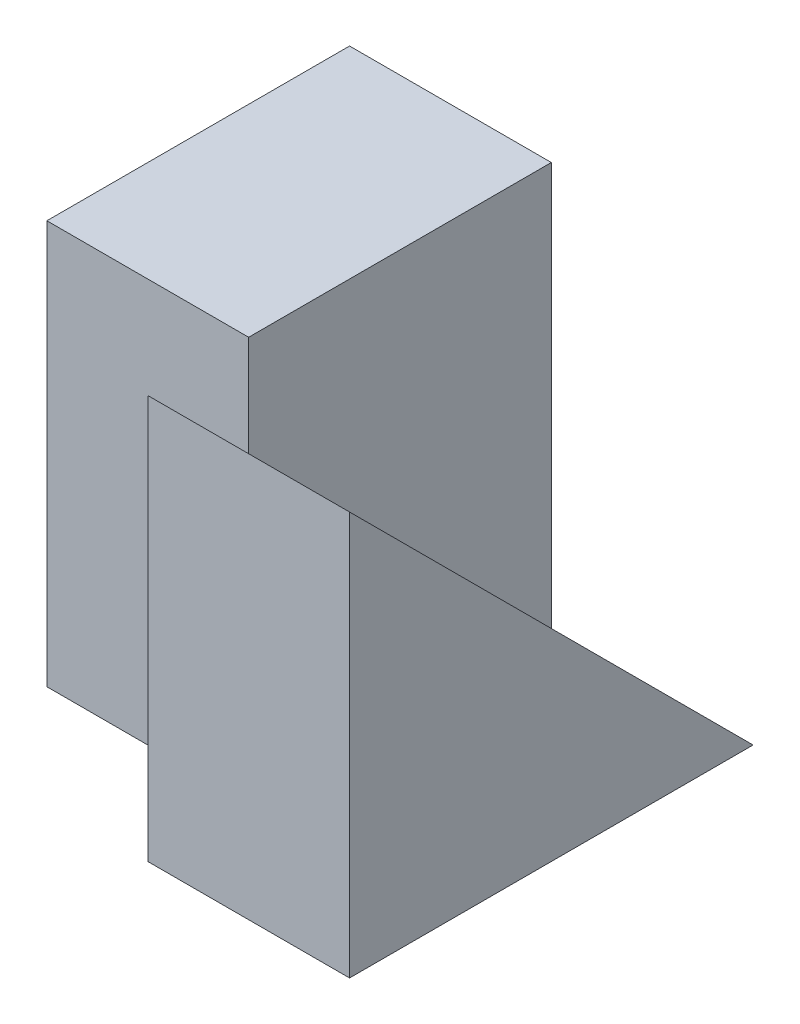
ISO-10303-21;
HEADER;
FILE_DESCRIPTION(('STEP AP214'),'2;1');
FILE_NAME('part.step','',(''),(''),'','','');
FILE_SCHEMA(('AUTOMOTIVE_DESIGN { 1 0 10303 214 1 1 1 1 }'));
ENDSEC;
DATA;
#1=APPLICATION_CONTEXT('core data for automotive mechanical design processes');
#2=APPLICATION_PROTOCOL_DEFINITION('international standard','automotive_design',2000,#1);
#3=PRODUCT_CONTEXT('',#1,'mechanical');
#4=PRODUCT('Part','Part','',(#3));
#5=PRODUCT_RELATED_PRODUCT_CATEGORY('part','',(#4));
#6=PRODUCT_DEFINITION_FORMATION('','',#4);
#7=PRODUCT_DEFINITION_CONTEXT('part definition',#1,'design');
#8=PRODUCT_DEFINITION('design','',#6,#7);
#9=PRODUCT_DEFINITION_SHAPE('','',#8);
#10=(LENGTH_UNIT() NAMED_UNIT(*) SI_UNIT(.MILLI.,.METRE.));
#11=(NAMED_UNIT(*) PLANE_ANGLE_UNIT() SI_UNIT($,.RADIAN.));
#12=(NAMED_UNIT(*) SI_UNIT($,.STERADIAN.) SOLID_ANGLE_UNIT());
#13=UNCERTAINTY_MEASURE_WITH_UNIT(LENGTH_MEASURE(1.E-05),#10,'distance_accuracy_value','');
#14=(GEOMETRIC_REPRESENTATION_CONTEXT(3) GLOBAL_UNCERTAINTY_ASSIGNED_CONTEXT((#13)) GLOBAL_UNIT_ASSIGNED_CONTEXT((#10,
#11,#12)) REPRESENTATION_CONTEXT('',''));
#15=CARTESIAN_POINT('',(0.,0.,0.));
#16=DIRECTION('',(0.,0.,1.));
#17=DIRECTION('',(1.,0.,0.));
#18=AXIS2_PLACEMENT_3D('',#15,#16,#17);
#19=CARTESIAN_POINT('',(2.,0.,-4.));
#20=DIRECTION('',(0.,0.,1.));
#21=DIRECTION('',(1.,0.,0.));
#22=AXIS2_PLACEMENT_3D('',#19,#20,#21);
#23=PLANE('',#22);
#24=DIRECTION('',(0.,1.,0.));
#25=VECTOR('',#24,1.);
#26=CARTESIAN_POINT('',(0.,4.,-4.));
#27=LINE('',#26,#25);
#28=CARTESIAN_POINT('',(0.,0.,-4.));
#29=VERTEX_POINT('',#28);
#30=CARTESIAN_POINT('',(0.,4.,-4.));
#31=VERTEX_POINT('',#30);
#32=EDGE_CURVE('E96',#29,#31,#27,.T.);
#33=ORIENTED_EDGE('',*,*,#32,.F.);
#34=DIRECTION('',(-1.,0.,0.));
#35=VECTOR('',#34,1.);
#36=CARTESIAN_POINT('',(2.,0.,-4.));
#37=LINE('',#36,#35);
#38=CARTESIAN_POINT('',(-2.,0.,-4.));
#39=VERTEX_POINT('',#38);
#40=EDGE_CURVE('E121',#29,#39,#37,.T.);
#41=ORIENTED_EDGE('',*,*,#40,.T.);
#42=DIRECTION('',(0.,-1.,0.));
#43=VECTOR('',#42,1.);
#44=CARTESIAN_POINT('',(-2.,4.,-4.));
#45=LINE('',#44,#43);
#46=CARTESIAN_POINT('',(-2.,4.,-4.));
#47=VERTEX_POINT('',#46);
#48=EDGE_CURVE('E120',#47,#39,#45,.T.);
#49=ORIENTED_EDGE('',*,*,#48,.F.);
#50=DIRECTION('',(-1.,0.,0.));
#51=VECTOR('',#50,1.);
#52=CARTESIAN_POINT('',(2.,4.,-4.));
#53=LINE('',#52,#51);
#54=EDGE_CURVE('E113',#31,#47,#53,.T.);
#55=ORIENTED_EDGE('',*,*,#54,.F.);
#56=EDGE_LOOP('',(#33,#41,#49,#55));
#57=FACE_BOUND('',#56,.T.);
#58=ADVANCED_FACE('F33',(#57),#23,.F.);
#59=CARTESIAN_POINT('',(2.,4.,0.));
#60=DIRECTION('',(0.,-1.,0.));
#61=DIRECTION('',(0.,0.,-1.));
#62=AXIS2_PLACEMENT_3D('',#59,#60,#61);
#63=PLANE('',#62);
#64=DIRECTION('',(0.,0.,1.));
#65=VECTOR('',#64,1.);
#66=CARTESIAN_POINT('',(0.,3.99999999999996,0.));
#67=LINE('',#66,#65);
#68=CARTESIAN_POINT('',(0.,4.,-1.));
#69=VERTEX_POINT('',#68);
#70=EDGE_CURVE('E99',#31,#69,#67,.T.);
#71=ORIENTED_EDGE('',*,*,#70,.F.);
#72=ORIENTED_EDGE('',*,*,#54,.T.);
#73=DIRECTION('',(0.,0.,-1.));
#74=VECTOR('',#73,1.);
#75=CARTESIAN_POINT('',(-2.,4.,-1.));
#76=LINE('',#75,#74);
#77=CARTESIAN_POINT('',(-2.,4.,-1.));
#78=VERTEX_POINT('',#77);
#79=EDGE_CURVE('E144',#78,#47,#76,.T.);
#80=ORIENTED_EDGE('',*,*,#79,.F.);
#81=DIRECTION('',(1.,0.,0.));
#82=VECTOR('',#81,1.);
#83=CARTESIAN_POINT('',(-2.,4.,-1.));
#84=LINE('',#83,#82);
#85=EDGE_CURVE('E116',#78,#69,#84,.T.);
#86=ORIENTED_EDGE('',*,*,#85,.T.);
#87=EDGE_LOOP('',(#71,#72,#80,#86));
#88=FACE_BOUND('',#87,.T.);
#89=ADVANCED_FACE('F111',(#88),#63,.F.);
#90=CARTESIAN_POINT('',(2.,0.,0.));
#91=DIRECTION('',(0.,0.,-1.));
#92=DIRECTION('',(-1.,0.,0.));
#93=AXIS2_PLACEMENT_3D('',#90,#91,#92);
#94=PLANE('',#93);
#95=DIRECTION('',(0.,-1.,0.));
#96=VECTOR('',#95,1.);
#97=CARTESIAN_POINT('',(0.,0.,0.));
#98=LINE('',#97,#96);
#99=CARTESIAN_POINT('',(0.,3.99999999999996,0.));
#100=VERTEX_POINT('',#99);
#101=CARTESIAN_POINT('',(0.,0.,0.));
#102=VERTEX_POINT('',#101);
#103=EDGE_CURVE('E132',#100,#102,#98,.T.);
#104=ORIENTED_EDGE('',*,*,#103,.T.);
#105=DIRECTION('',(-1.,0.,0.));
#106=VECTOR('',#105,1.);
#107=CARTESIAN_POINT('',(2.,0.,0.));
#108=LINE('',#107,#106);
#109=CARTESIAN_POINT('',(2.,0.,0.));
#110=VERTEX_POINT('',#109);
#111=EDGE_CURVE('E11',#110,#102,#108,.T.);
#112=ORIENTED_EDGE('',*,*,#111,.F.);
#113=DIRECTION('',(0.,-1.,0.));
#114=VECTOR('',#113,1.);
#115=CARTESIAN_POINT('',(2.,0.,0.));
#116=LINE('',#115,#114);
#117=CARTESIAN_POINT('',(2.,3.99999999999996,0.));
#118=VERTEX_POINT('',#117);
#119=EDGE_CURVE('E131',#118,#110,#116,.T.);
#120=ORIENTED_EDGE('',*,*,#119,.F.);
#121=DIRECTION('',(-1.,0.,0.));
#122=VECTOR('',#121,1.);
#123=CARTESIAN_POINT('',(2.,4.,0.));
#124=LINE('',#123,#122);
#125=EDGE_CURVE('E122',#118,#100,#124,.T.);
#126=ORIENTED_EDGE('',*,*,#125,.T.);
#127=EDGE_LOOP('',(#104,#112,#120,#126));
#128=FACE_BOUND('',#127,.T.);
#129=ADVANCED_FACE('F35',(#128),#94,.F.);
#130=CARTESIAN_POINT('',(2.,0.,0.));
#131=DIRECTION('',(0.,1.,0.));
#132=DIRECTION('',(0.,0.,1.));
#133=AXIS2_PLACEMENT_3D('',#130,#131,#132);
#134=PLANE('',#133);
#135=DIRECTION('',(0.,0.,-1.));
#136=VECTOR('',#135,1.);
#137=CARTESIAN_POINT('',(0.,0.,0.));
#138=LINE('',#137,#136);
#139=CARTESIAN_POINT('',(0.,0.,-1.));
#140=VERTEX_POINT('',#139);
#141=EDGE_CURVE('E129',#102,#140,#138,.T.);
#142=ORIENTED_EDGE('',*,*,#141,.T.);
#143=DIRECTION('',(1.,0.,0.));
#144=VECTOR('',#143,1.);
#145=CARTESIAN_POINT('',(-2.,0.,-1.));
#146=LINE('',#145,#144);
#147=CARTESIAN_POINT('',(-2.,0.,-1.));
#148=VERTEX_POINT('',#147);
#149=EDGE_CURVE('E138',#148,#140,#146,.T.);
#150=ORIENTED_EDGE('',*,*,#149,.F.);
#151=DIRECTION('',(0.,0.,1.));
#152=VECTOR('',#151,1.);
#153=CARTESIAN_POINT('',(-2.,0.,-4.));
#154=LINE('',#153,#152);
#155=EDGE_CURVE('E148',#39,#148,#154,.T.);
#156=ORIENTED_EDGE('',*,*,#155,.F.);
#157=ORIENTED_EDGE('',*,*,#40,.F.);
#158=CARTESIAN_POINT('',(2.,0.,-4.));
#159=VERTEX_POINT('',#158);
#160=EDGE_CURVE('E43',#159,#29,#37,.T.);
#161=ORIENTED_EDGE('',*,*,#160,.F.);
#162=DIRECTION('',(0.,0.,-1.));
#163=VECTOR('',#162,1.);
#164=CARTESIAN_POINT('',(2.,0.,0.));
#165=LINE('',#164,#163);
#166=EDGE_CURVE('E59',#110,#159,#165,.T.);
#167=ORIENTED_EDGE('',*,*,#166,.F.);
#168=ORIENTED_EDGE('',*,*,#111,.T.);
#169=EDGE_LOOP('',(#142,#150,#156,#157,#161,#167,#168));
#170=FACE_BOUND('',#169,.T.);
#171=ADVANCED_FACE('F165',(#170),#134,.F.);
#172=CARTESIAN_POINT('',(2.,0.,0.));
#173=DIRECTION('',(-1.,0.,0.));
#174=DIRECTION('',(0.,0.,1.));
#175=AXIS2_PLACEMENT_3D('',#172,#173,#174);
#176=PLANE('',#175);
#177=ORIENTED_EDGE('',*,*,#166,.T.);
#178=DIRECTION('',(0.,-0.707106781186544,-0.707106781186551));
#179=VECTOR('',#178,1.);
#180=CARTESIAN_POINT('',(2.,0.,-4.));
#181=LINE('',#180,#179);
#182=EDGE_CURVE('E107',#118,#159,#181,.T.);
#183=ORIENTED_EDGE('',*,*,#182,.F.);
#184=ORIENTED_EDGE('',*,*,#119,.T.);
#185=EDGE_LOOP('',(#177,#183,#184));
#186=FACE_BOUND('',#185,.T.);
#187=ADVANCED_FACE('F174',(#186),#176,.F.);
#188=CARTESIAN_POINT('',(0.,0.,0.));
#189=DIRECTION('',(-1.,0.,0.));
#190=DIRECTION('',(0.,0.,1.));
#191=AXIS2_PLACEMENT_3D('',#188,#189,#190);
#192=PLANE('',#191);
#193=DIRECTION('',(0.,-0.707106781186544,-0.707106781186551));
#194=VECTOR('',#193,1.);
#195=CARTESIAN_POINT('',(0.,0.,-4.));
#196=LINE('',#195,#194);
#197=CARTESIAN_POINT('',(0.,2.99999999999997,-1.));
#198=VERTEX_POINT('',#197);
#199=EDGE_CURVE('E154',#100,#198,#196,.T.);
#200=ORIENTED_EDGE('',*,*,#199,.T.);
#201=DIRECTION('',(0.,1.,0.));
#202=VECTOR('',#201,1.);
#203=CARTESIAN_POINT('',(0.,0.,-1.));
#204=LINE('',#203,#202);
#205=EDGE_CURVE('E51',#140,#198,#204,.T.);
#206=ORIENTED_EDGE('',*,*,#205,.F.);
#207=ORIENTED_EDGE('',*,*,#141,.F.);
#208=ORIENTED_EDGE('',*,*,#103,.F.);
#209=EDGE_LOOP('',(#200,#206,#207,#208));
#210=FACE_BOUND('',#209,.T.);
#211=ADVANCED_FACE('F167',(#210),#192,.T.);
#212=CARTESIAN_POINT('',(-2.,0.,-1.));
#213=DIRECTION('',(0.,0.,-1.));
#214=DIRECTION('',(-1.,0.,0.));
#215=AXIS2_PLACEMENT_3D('',#212,#213,#214);
#216=PLANE('',#215);
#217=ORIENTED_EDGE('',*,*,#205,.T.);
#218=EDGE_CURVE('E37',#198,#69,#204,.T.);
#219=ORIENTED_EDGE('',*,*,#218,.T.);
#220=ORIENTED_EDGE('',*,*,#85,.F.);
#221=DIRECTION('',(0.,1.,0.));
#222=VECTOR('',#221,1.);
#223=CARTESIAN_POINT('',(-2.,0.,-1.));
#224=LINE('',#223,#222);
#225=EDGE_CURVE('E146',#148,#78,#224,.T.);
#226=ORIENTED_EDGE('',*,*,#225,.F.);
#227=ORIENTED_EDGE('',*,*,#149,.T.);
#228=EDGE_LOOP('',(#217,#219,#220,#226,#227));
#229=FACE_BOUND('',#228,.T.);
#230=ADVANCED_FACE('F158',(#229),#216,.F.);
#231=CARTESIAN_POINT('',(-2.,0.,0.));
#232=DIRECTION('',(-1.,0.,0.));
#233=DIRECTION('',(0.,0.,1.));
#234=AXIS2_PLACEMENT_3D('',#231,#232,#233);
#235=PLANE('',#234);
#236=ORIENTED_EDGE('',*,*,#155,.T.);
#237=ORIENTED_EDGE('',*,*,#225,.T.);
#238=ORIENTED_EDGE('',*,*,#79,.T.);
#239=ORIENTED_EDGE('',*,*,#48,.T.);
#240=EDGE_LOOP('',(#236,#237,#238,#239));
#241=FACE_BOUND('',#240,.T.);
#242=ADVANCED_FACE('F176',(#241),#235,.T.);
#243=CARTESIAN_POINT('',(0.,0.,0.));
#244=DIRECTION('',(1.,0.,0.));
#245=DIRECTION('',(0.,0.,-1.));
#246=AXIS2_PLACEMENT_3D('',#243,#244,#245);
#247=PLANE('',#246);
#248=ORIENTED_EDGE('',*,*,#218,.F.);
#249=EDGE_CURVE('E102',#198,#29,#196,.T.);
#250=ORIENTED_EDGE('',*,*,#249,.T.);
#251=ORIENTED_EDGE('',*,*,#32,.T.);
#252=ORIENTED_EDGE('',*,*,#70,.T.);
#253=EDGE_LOOP('',(#248,#250,#251,#252));
#254=FACE_BOUND('',#253,.T.);
#255=ADVANCED_FACE('F98',(#254),#247,.T.);
#256=CARTESIAN_POINT('',(0.,0.,-4.));
#257=DIRECTION('',(0.,-0.707106781186551,0.707106781186544));
#258=DIRECTION('',(0.,-0.707106781186544,-0.707106781186551));
#259=AXIS2_PLACEMENT_3D('',#256,#257,#258);
#260=PLANE('',#259);
#261=ORIENTED_EDGE('',*,*,#182,.T.);
#262=ORIENTED_EDGE('',*,*,#160,.T.);
#263=ORIENTED_EDGE('',*,*,#249,.F.);
#264=ORIENTED_EDGE('',*,*,#199,.F.);
#265=ORIENTED_EDGE('',*,*,#125,.F.);
#266=EDGE_LOOP('',(#261,#262,#263,#264,#265));
#267=FACE_BOUND('',#266,.T.);
#268=ADVANCED_FACE('F172',(#267),#260,.F.);
#269=CLOSED_SHELL('',(#58,#89,#129,#171,#187,#211,#230,#242,#255,#268));
#270=MANIFOLD_SOLID_BREP('B2',#269);
#271=ADVANCED_BREP_SHAPE_REPRESENTATION('',(#18,#270),#14);
#272=SHAPE_DEFINITION_REPRESENTATION(#9,#271);
ENDSEC;
END-ISO-10303-21;
